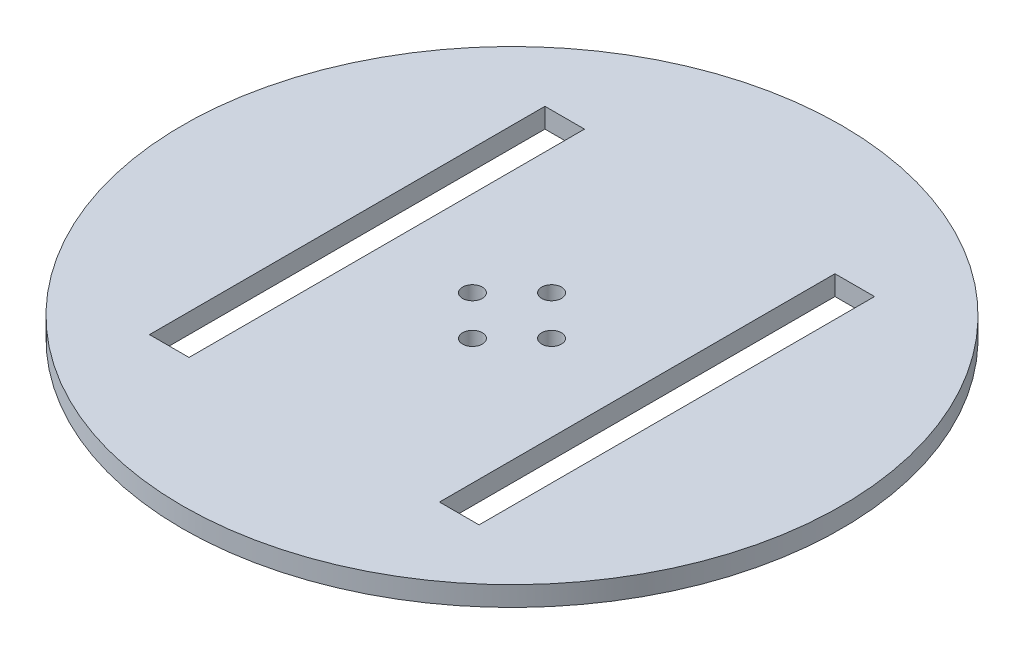
ISO-10303-21;
HEADER;
FILE_DESCRIPTION(('STEP AP214'),'2;1');
FILE_NAME('part.step','',(''),(''),'','','');
FILE_SCHEMA(('AUTOMOTIVE_DESIGN { 1 0 10303 214 1 1 1 1 }'));
ENDSEC;
DATA;
#1=APPLICATION_CONTEXT('core data for automotive mechanical design processes');
#2=APPLICATION_PROTOCOL_DEFINITION('international standard','automotive_design',2000,#1);
#3=PRODUCT_CONTEXT('',#1,'mechanical');
#4=PRODUCT('Part','Part','',(#3));
#5=PRODUCT_RELATED_PRODUCT_CATEGORY('part','',(#4));
#6=PRODUCT_DEFINITION_FORMATION('','',#4);
#7=PRODUCT_DEFINITION_CONTEXT('part definition',#1,'design');
#8=PRODUCT_DEFINITION('design','',#6,#7);
#9=PRODUCT_DEFINITION_SHAPE('','',#8);
#10=(LENGTH_UNIT() NAMED_UNIT(*) SI_UNIT(.MILLI.,.METRE.));
#11=(NAMED_UNIT(*) PLANE_ANGLE_UNIT() SI_UNIT($,.RADIAN.));
#12=(NAMED_UNIT(*) SI_UNIT($,.STERADIAN.) SOLID_ANGLE_UNIT());
#13=UNCERTAINTY_MEASURE_WITH_UNIT(LENGTH_MEASURE(1.E-05),#10,'distance_accuracy_value','');
#14=(GEOMETRIC_REPRESENTATION_CONTEXT(3) GLOBAL_UNCERTAINTY_ASSIGNED_CONTEXT((#13)) GLOBAL_UNIT_ASSIGNED_CONTEXT((#10,
#11,#12)) REPRESENTATION_CONTEXT('',''));
#15=CARTESIAN_POINT('',(0.,0.,0.));
#16=DIRECTION('',(0.,0.,1.));
#17=DIRECTION('',(1.,0.,0.));
#18=AXIS2_PLACEMENT_3D('',#15,#16,#17);
#19=CARTESIAN_POINT('',(0.,3.,0.));
#20=DIRECTION('',(0.,-1.,0.));
#21=DIRECTION('',(0.,0.,-1.));
#22=AXIS2_PLACEMENT_3D('',#19,#20,#21);
#23=CYLINDRICAL_SURFACE('',#22,50.);
#24=CARTESIAN_POINT('',(0.,3.,0.));
#25=DIRECTION('',(0.,1.,0.));
#26=DIRECTION('',(0.,0.,1.));
#27=AXIS2_PLACEMENT_3D('',#24,#25,#26);
#28=CIRCLE('',#27,50.);
#29=CARTESIAN_POINT('',(0.,3.,50.));
#30=VERTEX_POINT('',#29);
#31=EDGE_CURVE('E11',#30,#30,#28,.T.);
#32=ORIENTED_EDGE('',*,*,#31,.F.);
#33=EDGE_LOOP('',(#32));
#34=FACE_BOUND('',#33,.T.);
#35=CARTESIAN_POINT('',(0.,0.,0.));
#36=DIRECTION('',(0.,1.,0.));
#37=DIRECTION('',(0.,0.,1.));
#38=AXIS2_PLACEMENT_3D('',#35,#36,#37);
#39=CIRCLE('',#38,50.);
#40=CARTESIAN_POINT('',(0.,0.,50.));
#41=VERTEX_POINT('',#40);
#42=EDGE_CURVE('E45',#41,#41,#39,.T.);
#43=ORIENTED_EDGE('',*,*,#42,.T.);
#44=EDGE_LOOP('',(#43));
#45=FACE_BOUND('',#44,.T.);
#46=ADVANCED_FACE('F42',(#34,#45),#23,.T.);
#47=CARTESIAN_POINT('',(0.,3.,0.));
#48=DIRECTION('',(0.,1.,0.));
#49=DIRECTION('',(0.,0.,1.));
#50=AXIS2_PLACEMENT_3D('',#47,#48,#49);
#51=PLANE('',#50);
#52=DIRECTION('',(0.,0.,1.));
#53=VECTOR('',#52,1.);
#54=CARTESIAN_POINT('',(19.,3.,-30.));
#55=LINE('',#54,#53);
#56=CARTESIAN_POINT('',(19.,3.,-30.));
#57=VERTEX_POINT('',#56);
#58=CARTESIAN_POINT('',(19.,3.,30.));
#59=VERTEX_POINT('',#58);
#60=EDGE_CURVE('E57',#57,#59,#55,.T.);
#61=ORIENTED_EDGE('',*,*,#60,.F.);
#62=DIRECTION('',(-1.,0.,0.));
#63=VECTOR('',#62,1.);
#64=CARTESIAN_POINT('',(19.,3.,-30.));
#65=LINE('',#64,#63);
#66=CARTESIAN_POINT('',(25.,3.,-30.));
#67=VERTEX_POINT('',#66);
#68=EDGE_CURVE('E116',#67,#57,#65,.T.);
#69=ORIENTED_EDGE('',*,*,#68,.F.);
#70=DIRECTION('',(0.,0.,-1.));
#71=VECTOR('',#70,1.);
#72=CARTESIAN_POINT('',(25.,3.,-30.));
#73=LINE('',#72,#71);
#74=CARTESIAN_POINT('',(25.,3.,30.));
#75=VERTEX_POINT('',#74);
#76=EDGE_CURVE('E144',#75,#67,#73,.T.);
#77=ORIENTED_EDGE('',*,*,#76,.F.);
#78=DIRECTION('',(1.,0.,0.));
#79=VECTOR('',#78,1.);
#80=CARTESIAN_POINT('',(19.,3.,30.));
#81=LINE('',#80,#79);
#82=EDGE_CURVE('E136',#59,#75,#81,.T.);
#83=ORIENTED_EDGE('',*,*,#82,.F.);
#84=EDGE_LOOP('',(#61,#69,#77,#83));
#85=FACE_BOUND('',#84,.T.);
#86=DIRECTION('',(0.,0.,1.));
#87=VECTOR('',#86,1.);
#88=CARTESIAN_POINT('',(-25.,3.,-30.));
#89=LINE('',#88,#87);
#90=CARTESIAN_POINT('',(-25.,3.,-30.));
#91=VERTEX_POINT('',#90);
#92=CARTESIAN_POINT('',(-25.,3.,30.));
#93=VERTEX_POINT('',#92);
#94=EDGE_CURVE('E65',#91,#93,#89,.T.);
#95=ORIENTED_EDGE('',*,*,#94,.F.);
#96=DIRECTION('',(-1.,0.,0.));
#97=VECTOR('',#96,1.);
#98=CARTESIAN_POINT('',(-25.,3.,-30.));
#99=LINE('',#98,#97);
#100=CARTESIAN_POINT('',(-19.,3.,-30.));
#101=VERTEX_POINT('',#100);
#102=EDGE_CURVE('E166',#101,#91,#99,.T.);
#103=ORIENTED_EDGE('',*,*,#102,.F.);
#104=DIRECTION('',(0.,0.,-1.));
#105=VECTOR('',#104,1.);
#106=CARTESIAN_POINT('',(-19.,3.,-30.));
#107=LINE('',#106,#105);
#108=CARTESIAN_POINT('',(-19.,3.,30.));
#109=VERTEX_POINT('',#108);
#110=EDGE_CURVE('E178',#109,#101,#107,.T.);
#111=ORIENTED_EDGE('',*,*,#110,.F.);
#112=DIRECTION('',(1.,0.,0.));
#113=VECTOR('',#112,1.);
#114=CARTESIAN_POINT('',(-25.,3.,30.));
#115=LINE('',#114,#113);
#116=EDGE_CURVE('E182',#93,#109,#115,.T.);
#117=ORIENTED_EDGE('',*,*,#116,.F.);
#118=EDGE_LOOP('',(#95,#103,#111,#117));
#119=FACE_BOUND('',#118,.T.);
#120=CARTESIAN_POINT('',(0.,3.,-6.));
#121=DIRECTION('',(0.,1.,0.));
#122=DIRECTION('',(0.,0.,1.));
#123=AXIS2_PLACEMENT_3D('',#120,#121,#122);
#124=CIRCLE('',#123,1.5);
#125=CARTESIAN_POINT('',(0.,3.,-4.5));
#126=VERTEX_POINT('',#125);
#127=EDGE_CURVE('E199',#126,#126,#124,.T.);
#128=ORIENTED_EDGE('',*,*,#127,.F.);
#129=EDGE_LOOP('',(#128));
#130=FACE_BOUND('',#129,.T.);
#131=CARTESIAN_POINT('',(6.,3.,0.));
#132=DIRECTION('',(0.,1.,0.));
#133=DIRECTION('',(0.,0.,1.));
#134=AXIS2_PLACEMENT_3D('',#131,#132,#133);
#135=CIRCLE('',#134,1.5);
#136=CARTESIAN_POINT('',(6.,3.,1.5));
#137=VERTEX_POINT('',#136);
#138=EDGE_CURVE('E204',#137,#137,#135,.T.);
#139=ORIENTED_EDGE('',*,*,#138,.F.);
#140=EDGE_LOOP('',(#139));
#141=FACE_BOUND('',#140,.T.);
#142=CARTESIAN_POINT('',(0.,3.,6.));
#143=DIRECTION('',(0.,1.,0.));
#144=DIRECTION('',(0.,0.,1.));
#145=AXIS2_PLACEMENT_3D('',#142,#143,#144);
#146=CIRCLE('',#145,1.5);
#147=CARTESIAN_POINT('',(0.,3.,7.5));
#148=VERTEX_POINT('',#147);
#149=EDGE_CURVE('E212',#148,#148,#146,.T.);
#150=ORIENTED_EDGE('',*,*,#149,.F.);
#151=EDGE_LOOP('',(#150));
#152=FACE_BOUND('',#151,.T.);
#153=CARTESIAN_POINT('',(-6.,3.,0.));
#154=DIRECTION('',(0.,1.,0.));
#155=DIRECTION('',(0.,0.,1.));
#156=AXIS2_PLACEMENT_3D('',#153,#154,#155);
#157=CIRCLE('',#156,1.5);
#158=CARTESIAN_POINT('',(-6.,3.,1.5));
#159=VERTEX_POINT('',#158);
#160=EDGE_CURVE('E220',#159,#159,#157,.T.);
#161=ORIENTED_EDGE('',*,*,#160,.F.);
#162=EDGE_LOOP('',(#161));
#163=FACE_BOUND('',#162,.T.);
#164=ORIENTED_EDGE('',*,*,#31,.T.);
#165=EDGE_LOOP('',(#164));
#166=FACE_BOUND('',#165,.T.);
#167=ADVANCED_FACE('F234',(#85,#119,#130,#141,#152,#163,#166),#51,.T.);
#168=CARTESIAN_POINT('',(0.,0.,0.));
#169=DIRECTION('',(0.,1.,0.));
#170=DIRECTION('',(0.,0.,1.));
#171=AXIS2_PLACEMENT_3D('',#168,#169,#170);
#172=PLANE('',#171);
#173=DIRECTION('',(1.,0.,0.));
#174=VECTOR('',#173,1.);
#175=CARTESIAN_POINT('',(19.,0.,-30.));
#176=LINE('',#175,#174);
#177=CARTESIAN_POINT('',(19.,0.,-30.));
#178=VERTEX_POINT('',#177);
#179=CARTESIAN_POINT('',(25.,0.,-30.));
#180=VERTEX_POINT('',#179);
#181=EDGE_CURVE('E131',#178,#180,#176,.T.);
#182=ORIENTED_EDGE('',*,*,#181,.F.);
#183=DIRECTION('',(0.,0.,-1.));
#184=VECTOR('',#183,1.);
#185=CARTESIAN_POINT('',(19.,0.,-30.));
#186=LINE('',#185,#184);
#187=CARTESIAN_POINT('',(19.,0.,30.));
#188=VERTEX_POINT('',#187);
#189=EDGE_CURVE('E109',#188,#178,#186,.T.);
#190=ORIENTED_EDGE('',*,*,#189,.F.);
#191=DIRECTION('',(-1.,0.,0.));
#192=VECTOR('',#191,1.);
#193=CARTESIAN_POINT('',(19.,0.,30.));
#194=LINE('',#193,#192);
#195=CARTESIAN_POINT('',(25.,0.,30.));
#196=VERTEX_POINT('',#195);
#197=EDGE_CURVE('E120',#196,#188,#194,.T.);
#198=ORIENTED_EDGE('',*,*,#197,.F.);
#199=DIRECTION('',(0.,0.,1.));
#200=VECTOR('',#199,1.);
#201=CARTESIAN_POINT('',(25.,0.,-30.));
#202=LINE('',#201,#200);
#203=EDGE_CURVE('E138',#180,#196,#202,.T.);
#204=ORIENTED_EDGE('',*,*,#203,.F.);
#205=EDGE_LOOP('',(#182,#190,#198,#204));
#206=FACE_BOUND('',#205,.T.);
#207=DIRECTION('',(1.,0.,0.));
#208=VECTOR('',#207,1.);
#209=CARTESIAN_POINT('',(-25.,0.,-30.));
#210=LINE('',#209,#208);
#211=CARTESIAN_POINT('',(-25.,0.,-30.));
#212=VERTEX_POINT('',#211);
#213=CARTESIAN_POINT('',(-19.,0.,-30.));
#214=VERTEX_POINT('',#213);
#215=EDGE_CURVE('E192',#212,#214,#210,.T.);
#216=ORIENTED_EDGE('',*,*,#215,.F.);
#217=DIRECTION('',(0.,0.,-1.));
#218=VECTOR('',#217,1.);
#219=CARTESIAN_POINT('',(-25.,0.,-30.));
#220=LINE('',#219,#218);
#221=CARTESIAN_POINT('',(-25.,0.,30.));
#222=VERTEX_POINT('',#221);
#223=EDGE_CURVE('E188',#222,#212,#220,.T.);
#224=ORIENTED_EDGE('',*,*,#223,.F.);
#225=DIRECTION('',(-1.,0.,0.));
#226=VECTOR('',#225,1.);
#227=CARTESIAN_POINT('',(-25.,0.,30.));
#228=LINE('',#227,#226);
#229=CARTESIAN_POINT('',(-19.,0.,30.));
#230=VERTEX_POINT('',#229);
#231=EDGE_CURVE('E158',#230,#222,#228,.T.);
#232=ORIENTED_EDGE('',*,*,#231,.F.);
#233=DIRECTION('',(0.,0.,1.));
#234=VECTOR('',#233,1.);
#235=CARTESIAN_POINT('',(-19.,0.,-30.));
#236=LINE('',#235,#234);
#237=EDGE_CURVE('E196',#214,#230,#236,.T.);
#238=ORIENTED_EDGE('',*,*,#237,.F.);
#239=EDGE_LOOP('',(#216,#224,#232,#238));
#240=FACE_BOUND('',#239,.T.);
#241=CARTESIAN_POINT('',(0.,0.,-6.));
#242=DIRECTION('',(0.,1.,0.));
#243=DIRECTION('',(0.,0.,1.));
#244=AXIS2_PLACEMENT_3D('',#241,#242,#243);
#245=CIRCLE('',#244,1.5);
#246=CARTESIAN_POINT('',(0.,0.,-4.5));
#247=VERTEX_POINT('',#246);
#248=EDGE_CURVE('E203',#247,#247,#245,.F.);
#249=ORIENTED_EDGE('',*,*,#248,.F.);
#250=EDGE_LOOP('',(#249));
#251=FACE_BOUND('',#250,.T.);
#252=CARTESIAN_POINT('',(6.,0.,0.));
#253=DIRECTION('',(0.,1.,0.));
#254=DIRECTION('',(0.,0.,1.));
#255=AXIS2_PLACEMENT_3D('',#252,#253,#254);
#256=CIRCLE('',#255,1.5);
#257=CARTESIAN_POINT('',(6.,0.,1.5));
#258=VERTEX_POINT('',#257);
#259=EDGE_CURVE('E208',#258,#258,#256,.F.);
#260=ORIENTED_EDGE('',*,*,#259,.F.);
#261=EDGE_LOOP('',(#260));
#262=FACE_BOUND('',#261,.T.);
#263=CARTESIAN_POINT('',(0.,0.,6.));
#264=DIRECTION('',(0.,1.,0.));
#265=DIRECTION('',(0.,0.,1.));
#266=AXIS2_PLACEMENT_3D('',#263,#264,#265);
#267=CIRCLE('',#266,1.5);
#268=CARTESIAN_POINT('',(0.,0.,7.5));
#269=VERTEX_POINT('',#268);
#270=EDGE_CURVE('E216',#269,#269,#267,.F.);
#271=ORIENTED_EDGE('',*,*,#270,.F.);
#272=EDGE_LOOP('',(#271));
#273=FACE_BOUND('',#272,.T.);
#274=CARTESIAN_POINT('',(-6.,0.,0.));
#275=DIRECTION('',(0.,1.,0.));
#276=DIRECTION('',(0.,0.,1.));
#277=AXIS2_PLACEMENT_3D('',#274,#275,#276);
#278=CIRCLE('',#277,1.5);
#279=CARTESIAN_POINT('',(-6.,0.,1.5));
#280=VERTEX_POINT('',#279);
#281=EDGE_CURVE('E125',#280,#280,#278,.F.);
#282=ORIENTED_EDGE('',*,*,#281,.F.);
#283=EDGE_LOOP('',(#282));
#284=FACE_BOUND('',#283,.T.);
#285=ORIENTED_EDGE('',*,*,#42,.F.);
#286=EDGE_LOOP('',(#285));
#287=FACE_BOUND('',#286,.T.);
#288=ADVANCED_FACE('F128',(#206,#240,#251,#262,#273,#284,#287),#172,.F.);
#289=CARTESIAN_POINT('',(-6.,-0.00100000000000013,0.));
#290=DIRECTION('',(0.,1.,0.));
#291=DIRECTION('',(0.,0.,1.));
#292=AXIS2_PLACEMENT_3D('',#289,#290,#291);
#293=CYLINDRICAL_SURFACE('',#292,1.5);
#294=ORIENTED_EDGE('',*,*,#160,.T.);
#295=EDGE_LOOP('',(#294));
#296=FACE_BOUND('',#295,.T.);
#297=ORIENTED_EDGE('',*,*,#281,.T.);
#298=EDGE_LOOP('',(#297));
#299=FACE_BOUND('',#298,.T.);
#300=ADVANCED_FACE('F231',(#296,#299),#293,.F.);
#301=CARTESIAN_POINT('',(0.,-0.00100000000000013,6.));
#302=DIRECTION('',(0.,1.,0.));
#303=DIRECTION('',(0.,0.,1.));
#304=AXIS2_PLACEMENT_3D('',#301,#302,#303);
#305=CYLINDRICAL_SURFACE('',#304,1.5);
#306=ORIENTED_EDGE('',*,*,#149,.T.);
#307=EDGE_LOOP('',(#306));
#308=FACE_BOUND('',#307,.T.);
#309=ORIENTED_EDGE('',*,*,#270,.T.);
#310=EDGE_LOOP('',(#309));
#311=FACE_BOUND('',#310,.T.);
#312=ADVANCED_FACE('F251',(#308,#311),#305,.F.);
#313=CARTESIAN_POINT('',(6.,-0.00100000000000013,0.));
#314=DIRECTION('',(0.,1.,0.));
#315=DIRECTION('',(0.,0.,1.));
#316=AXIS2_PLACEMENT_3D('',#313,#314,#315);
#317=CYLINDRICAL_SURFACE('',#316,1.5);
#318=ORIENTED_EDGE('',*,*,#138,.T.);
#319=EDGE_LOOP('',(#318));
#320=FACE_BOUND('',#319,.T.);
#321=ORIENTED_EDGE('',*,*,#259,.T.);
#322=EDGE_LOOP('',(#321));
#323=FACE_BOUND('',#322,.T.);
#324=ADVANCED_FACE('F256',(#320,#323),#317,.F.);
#325=CARTESIAN_POINT('',(0.,-0.00100000000000013,-6.));
#326=DIRECTION('',(0.,1.,0.));
#327=DIRECTION('',(0.,0.,1.));
#328=AXIS2_PLACEMENT_3D('',#325,#326,#327);
#329=CYLINDRICAL_SURFACE('',#328,1.5);
#330=ORIENTED_EDGE('',*,*,#127,.T.);
#331=EDGE_LOOP('',(#330));
#332=FACE_BOUND('',#331,.T.);
#333=ORIENTED_EDGE('',*,*,#248,.T.);
#334=EDGE_LOOP('',(#333));
#335=FACE_BOUND('',#334,.T.);
#336=ADVANCED_FACE('F260',(#332,#335),#329,.F.);
#337=CARTESIAN_POINT('',(-25.,-0.00100000000000013,-30.));
#338=DIRECTION('',(-1.,0.,0.));
#339=DIRECTION('',(0.,0.,1.));
#340=AXIS2_PLACEMENT_3D('',#337,#338,#339);
#341=PLANE('',#340);
#342=ORIENTED_EDGE('',*,*,#223,.T.);
#343=DIRECTION('',(0.,1.,0.));
#344=VECTOR('',#343,1.);
#345=CARTESIAN_POINT('',(-25.,-0.00100000000000013,-30.));
#346=LINE('',#345,#344);
#347=EDGE_CURVE('E162',#212,#91,#346,.T.);
#348=ORIENTED_EDGE('',*,*,#347,.T.);
#349=ORIENTED_EDGE('',*,*,#94,.T.);
#350=DIRECTION('',(0.,1.,0.));
#351=VECTOR('',#350,1.);
#352=CARTESIAN_POINT('',(-25.,-0.00100000000000013,30.));
#353=LINE('',#352,#351);
#354=EDGE_CURVE('E163',#222,#93,#353,.T.);
#355=ORIENTED_EDGE('',*,*,#354,.F.);
#356=EDGE_LOOP('',(#342,#348,#349,#355));
#357=FACE_BOUND('',#356,.T.);
#358=ADVANCED_FACE('F264',(#357),#341,.F.);
#359=CARTESIAN_POINT('',(-25.,-0.00100000000000013,-30.));
#360=DIRECTION('',(0.,0.,-1.));
#361=DIRECTION('',(-1.,0.,0.));
#362=AXIS2_PLACEMENT_3D('',#359,#360,#361);
#363=PLANE('',#362);
#364=ORIENTED_EDGE('',*,*,#215,.T.);
#365=DIRECTION('',(0.,1.,0.));
#366=VECTOR('',#365,1.);
#367=CARTESIAN_POINT('',(-19.,-0.00100000000000013,-30.));
#368=LINE('',#367,#366);
#369=EDGE_CURVE('E170',#214,#101,#368,.T.);
#370=ORIENTED_EDGE('',*,*,#369,.T.);
#371=ORIENTED_EDGE('',*,*,#102,.T.);
#372=ORIENTED_EDGE('',*,*,#347,.F.);
#373=EDGE_LOOP('',(#364,#370,#371,#372));
#374=FACE_BOUND('',#373,.T.);
#375=ADVANCED_FACE('F266',(#374),#363,.F.);
#376=CARTESIAN_POINT('',(-19.,-0.00100000000000013,-30.));
#377=DIRECTION('',(1.,0.,0.));
#378=DIRECTION('',(0.,0.,-1.));
#379=AXIS2_PLACEMENT_3D('',#376,#377,#378);
#380=PLANE('',#379);
#381=ORIENTED_EDGE('',*,*,#237,.T.);
#382=DIRECTION('',(0.,1.,0.));
#383=VECTOR('',#382,1.);
#384=CARTESIAN_POINT('',(-19.,-0.00100000000000013,30.));
#385=LINE('',#384,#383);
#386=EDGE_CURVE('E167',#230,#109,#385,.T.);
#387=ORIENTED_EDGE('',*,*,#386,.T.);
#388=ORIENTED_EDGE('',*,*,#110,.T.);
#389=ORIENTED_EDGE('',*,*,#369,.F.);
#390=EDGE_LOOP('',(#381,#387,#388,#389));
#391=FACE_BOUND('',#390,.T.);
#392=ADVANCED_FACE('F269',(#391),#380,.F.);
#393=CARTESIAN_POINT('',(-25.,-0.00100000000000013,30.));
#394=DIRECTION('',(0.,0.,1.));
#395=DIRECTION('',(1.,0.,0.));
#396=AXIS2_PLACEMENT_3D('',#393,#394,#395);
#397=PLANE('',#396);
#398=ORIENTED_EDGE('',*,*,#231,.T.);
#399=ORIENTED_EDGE('',*,*,#354,.T.);
#400=ORIENTED_EDGE('',*,*,#116,.T.);
#401=ORIENTED_EDGE('',*,*,#386,.F.);
#402=EDGE_LOOP('',(#398,#399,#400,#401));
#403=FACE_BOUND('',#402,.T.);
#404=ADVANCED_FACE('F273',(#403),#397,.F.);
#405=CARTESIAN_POINT('',(19.,-0.00100000000000013,-30.));
#406=DIRECTION('',(-1.,0.,0.));
#407=DIRECTION('',(0.,0.,1.));
#408=AXIS2_PLACEMENT_3D('',#405,#406,#407);
#409=PLANE('',#408);
#410=ORIENTED_EDGE('',*,*,#189,.T.);
#411=DIRECTION('',(0.,1.,0.));
#412=VECTOR('',#411,1.);
#413=CARTESIAN_POINT('',(19.,-0.00100000000000013,-30.));
#414=LINE('',#413,#412);
#415=EDGE_CURVE('E126',#178,#57,#414,.T.);
#416=ORIENTED_EDGE('',*,*,#415,.T.);
#417=ORIENTED_EDGE('',*,*,#60,.T.);
#418=DIRECTION('',(0.,1.,0.));
#419=VECTOR('',#418,1.);
#420=CARTESIAN_POINT('',(19.,-0.00100000000000013,30.));
#421=LINE('',#420,#419);
#422=EDGE_CURVE('E105',#188,#59,#421,.T.);
#423=ORIENTED_EDGE('',*,*,#422,.F.);
#424=EDGE_LOOP('',(#410,#416,#417,#423));
#425=FACE_BOUND('',#424,.T.);
#426=ADVANCED_FACE('F107',(#425),#409,.F.);
#427=CARTESIAN_POINT('',(19.,-0.00100000000000013,-30.));
#428=DIRECTION('',(0.,0.,-1.));
#429=DIRECTION('',(-1.,0.,0.));
#430=AXIS2_PLACEMENT_3D('',#427,#428,#429);
#431=PLANE('',#430);
#432=ORIENTED_EDGE('',*,*,#181,.T.);
#433=DIRECTION('',(0.,1.,0.));
#434=VECTOR('',#433,1.);
#435=CARTESIAN_POINT('',(25.,-0.00100000000000013,-30.));
#436=LINE('',#435,#434);
#437=EDGE_CURVE('E153',#180,#67,#436,.T.);
#438=ORIENTED_EDGE('',*,*,#437,.T.);
#439=ORIENTED_EDGE('',*,*,#68,.T.);
#440=ORIENTED_EDGE('',*,*,#415,.F.);
#441=EDGE_LOOP('',(#432,#438,#439,#440));
#442=FACE_BOUND('',#441,.T.);
#443=ADVANCED_FACE('F282',(#442),#431,.F.);
#444=CARTESIAN_POINT('',(25.,-0.00100000000000013,-30.));
#445=DIRECTION('',(1.,0.,0.));
#446=DIRECTION('',(0.,0.,-1.));
#447=AXIS2_PLACEMENT_3D('',#444,#445,#446);
#448=PLANE('',#447);
#449=ORIENTED_EDGE('',*,*,#203,.T.);
#450=DIRECTION('',(0.,1.,0.));
#451=VECTOR('',#450,1.);
#452=CARTESIAN_POINT('',(25.,-0.00100000000000013,30.));
#453=LINE('',#452,#451);
#454=EDGE_CURVE('E115',#196,#75,#453,.T.);
#455=ORIENTED_EDGE('',*,*,#454,.T.);
#456=ORIENTED_EDGE('',*,*,#76,.T.);
#457=ORIENTED_EDGE('',*,*,#437,.F.);
#458=EDGE_LOOP('',(#449,#455,#456,#457));
#459=FACE_BOUND('',#458,.T.);
#460=ADVANCED_FACE('F285',(#459),#448,.F.);
#461=CARTESIAN_POINT('',(19.,-0.00100000000000013,30.));
#462=DIRECTION('',(0.,0.,1.));
#463=DIRECTION('',(1.,0.,0.));
#464=AXIS2_PLACEMENT_3D('',#461,#462,#463);
#465=PLANE('',#464);
#466=ORIENTED_EDGE('',*,*,#197,.T.);
#467=ORIENTED_EDGE('',*,*,#422,.T.);
#468=ORIENTED_EDGE('',*,*,#82,.T.);
#469=ORIENTED_EDGE('',*,*,#454,.F.);
#470=EDGE_LOOP('',(#466,#467,#468,#469));
#471=FACE_BOUND('',#470,.T.);
#472=ADVANCED_FACE('F121',(#471),#465,.F.);
#473=CLOSED_SHELL('',(#46,#167,#288,#300,#312,#324,#336,#358,#375,#392,#404,#426,#443,#460,#472));
#474=MANIFOLD_SOLID_BREP('B2',#473);
#475=ADVANCED_BREP_SHAPE_REPRESENTATION('',(#18,#474),#14);
#476=SHAPE_DEFINITION_REPRESENTATION(#9,#475);
ENDSEC;
END-ISO-10303-21;
